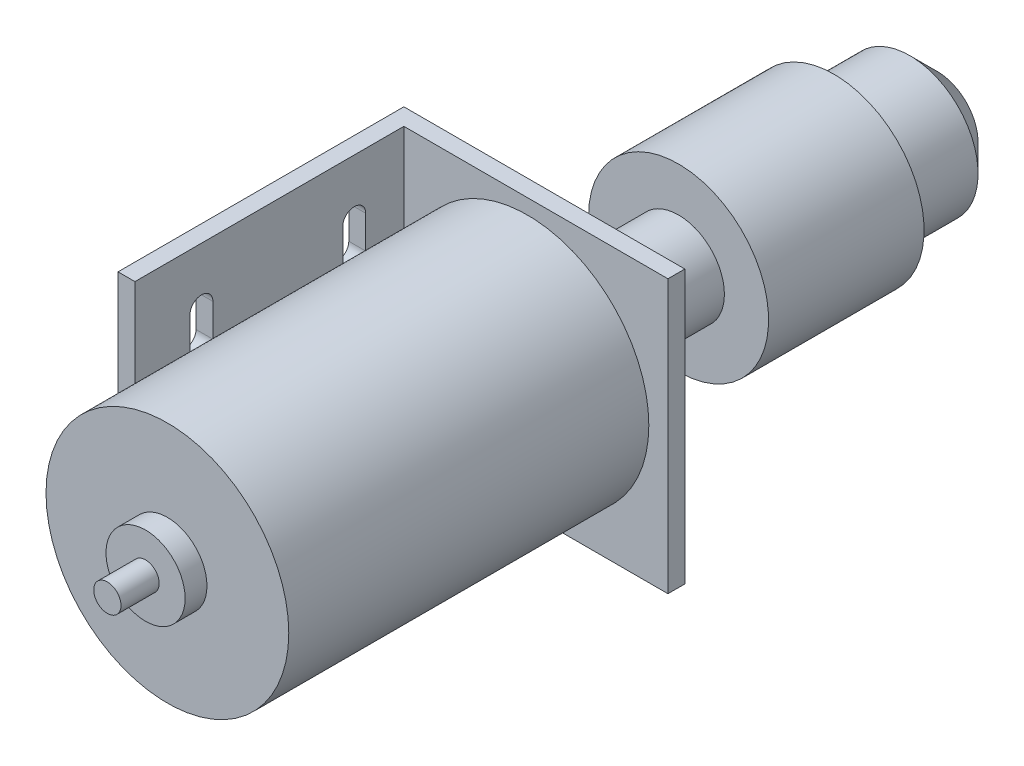
ISO-10303-21;
HEADER;
FILE_DESCRIPTION(('STEP AP214'),'2;1');
FILE_NAME('part.step','',(''),(''),'','','');
FILE_SCHEMA(('AUTOMOTIVE_DESIGN { 1 0 10303 214 1 1 1 1 }'));
ENDSEC;
DATA;
#1=APPLICATION_CONTEXT('core data for automotive mechanical design processes');
#2=APPLICATION_PROTOCOL_DEFINITION('international standard','automotive_design',2000,#1);
#3=PRODUCT_CONTEXT('',#1,'mechanical');
#4=PRODUCT('Part','Part','',(#3));
#5=PRODUCT_RELATED_PRODUCT_CATEGORY('part','',(#4));
#6=PRODUCT_DEFINITION_FORMATION('','',#4);
#7=PRODUCT_DEFINITION_CONTEXT('part definition',#1,'design');
#8=PRODUCT_DEFINITION('design','',#6,#7);
#9=PRODUCT_DEFINITION_SHAPE('','',#8);
#10=(LENGTH_UNIT() NAMED_UNIT(*) SI_UNIT(.MILLI.,.METRE.));
#11=(NAMED_UNIT(*) PLANE_ANGLE_UNIT() SI_UNIT($,.RADIAN.));
#12=(NAMED_UNIT(*) SI_UNIT($,.STERADIAN.) SOLID_ANGLE_UNIT());
#13=UNCERTAINTY_MEASURE_WITH_UNIT(LENGTH_MEASURE(1.E-05),#10,'distance_accuracy_value','');
#14=(GEOMETRIC_REPRESENTATION_CONTEXT(3) GLOBAL_UNCERTAINTY_ASSIGNED_CONTEXT((#13)) GLOBAL_UNIT_ASSIGNED_CONTEXT((#10,
#11,#12)) REPRESENTATION_CONTEXT('',''));
#15=CARTESIAN_POINT('',(0.,0.,0.));
#16=DIRECTION('',(0.,0.,1.));
#17=DIRECTION('',(1.,0.,0.));
#18=AXIS2_PLACEMENT_3D('',#15,#16,#17);
#19=CARTESIAN_POINT('',(0.,0.,0.));
#20=DIRECTION('',(0.,0.,1.));
#21=DIRECTION('',(1.,0.,0.));
#22=AXIS2_PLACEMENT_3D('',#19,#20,#21);
#23=PLANE('',#22);
#24=CARTESIAN_POINT('',(0.,0.,0.));
#25=DIRECTION('',(0.,0.,1.));
#26=DIRECTION('',(1.,0.,0.));
#27=AXIS2_PLACEMENT_3D('',#24,#25,#26);
#28=CIRCLE('',#27,22.25);
#29=CARTESIAN_POINT('',(22.25,0.,0.));
#30=VERTEX_POINT('',#29);
#31=EDGE_CURVE('E474',#30,#30,#28,.T.);
#32=ORIENTED_EDGE('',*,*,#31,.F.);
#33=EDGE_LOOP('',(#32));
#34=FACE_BOUND('',#33,.T.);
#35=DIRECTION('',(1.,0.,0.));
#36=VECTOR('',#35,1.);
#37=CARTESIAN_POINT('',(25.75,25.,0.));
#38=LINE('',#37,#36);
#39=CARTESIAN_POINT('',(-22.65,25.,0.));
#40=VERTEX_POINT('',#39);
#41=CARTESIAN_POINT('',(25.75,25.,0.));
#42=VERTEX_POINT('',#41);
#43=EDGE_CURVE('E434',#40,#42,#38,.T.);
#44=ORIENTED_EDGE('',*,*,#43,.F.);
#45=DIRECTION('',(0.,1.,0.));
#46=VECTOR('',#45,1.);
#47=CARTESIAN_POINT('',(-22.65,25.,0.));
#48=LINE('',#47,#46);
#49=CARTESIAN_POINT('',(-22.65,-25.,0.));
#50=VERTEX_POINT('',#49);
#51=EDGE_CURVE('E380',#50,#40,#48,.T.);
#52=ORIENTED_EDGE('',*,*,#51,.F.);
#53=DIRECTION('',(-1.,0.,0.));
#54=VECTOR('',#53,1.);
#55=CARTESIAN_POINT('',(25.75,-25.,0.));
#56=LINE('',#55,#54);
#57=CARTESIAN_POINT('',(25.75,-25.,0.));
#58=VERTEX_POINT('',#57);
#59=EDGE_CURVE('E443',#58,#50,#56,.T.);
#60=ORIENTED_EDGE('',*,*,#59,.F.);
#61=DIRECTION('',(0.,-1.,0.));
#62=VECTOR('',#61,1.);
#63=CARTESIAN_POINT('',(25.75,-25.,0.));
#64=LINE('',#63,#62);
#65=EDGE_CURVE('E455',#42,#58,#64,.T.);
#66=ORIENTED_EDGE('',*,*,#65,.F.);
#67=EDGE_LOOP('',(#44,#52,#60,#66));
#68=FACE_BOUND('',#67,.T.);
#69=ADVANCED_FACE('F63',(#34,#68),#23,.T.);
#70=CARTESIAN_POINT('',(0.,0.,66.));
#71=DIRECTION('',(0.,0.,-1.));
#72=DIRECTION('',(-1.,0.,0.));
#73=AXIS2_PLACEMENT_3D('',#70,#71,#72);
#74=CYLINDRICAL_SURFACE('',#73,22.25);
#75=CARTESIAN_POINT('',(0.,0.,66.));
#76=DIRECTION('',(0.,0.,1.));
#77=DIRECTION('',(1.,0.,0.));
#78=AXIS2_PLACEMENT_3D('',#75,#76,#77);
#79=CIRCLE('',#78,22.25);
#80=CARTESIAN_POINT('',(22.25,0.,66.));
#81=VERTEX_POINT('',#80);
#82=EDGE_CURVE('E491',#81,#81,#79,.T.);
#83=ORIENTED_EDGE('',*,*,#82,.F.);
#84=EDGE_LOOP('',(#83));
#85=FACE_BOUND('',#84,.T.);
#86=ORIENTED_EDGE('',*,*,#31,.T.);
#87=EDGE_LOOP('',(#86));
#88=FACE_BOUND('',#87,.T.);
#89=ADVANCED_FACE('F525',(#85,#88),#74,.T.);
#90=CARTESIAN_POINT('',(0.,0.,66.));
#91=DIRECTION('',(0.,0.,1.));
#92=DIRECTION('',(1.,0.,0.));
#93=AXIS2_PLACEMENT_3D('',#90,#91,#92);
#94=PLANE('',#93);
#95=CARTESIAN_POINT('',(0.,0.,66.));
#96=DIRECTION('',(0.,0.,1.));
#97=DIRECTION('',(1.,0.,0.));
#98=AXIS2_PLACEMENT_3D('',#95,#96,#97);
#99=CIRCLE('',#98,7.25);
#100=CARTESIAN_POINT('',(7.25,0.,66.));
#101=VERTEX_POINT('',#100);
#102=EDGE_CURVE('E487',#101,#101,#99,.T.);
#103=ORIENTED_EDGE('',*,*,#102,.F.);
#104=EDGE_LOOP('',(#103));
#105=FACE_BOUND('',#104,.T.);
#106=ORIENTED_EDGE('',*,*,#82,.T.);
#107=EDGE_LOOP('',(#106));
#108=FACE_BOUND('',#107,.T.);
#109=ADVANCED_FACE('F532',(#105,#108),#94,.T.);
#110=CARTESIAN_POINT('',(0.,0.,70.));
#111=DIRECTION('',(0.,0.,-1.));
#112=DIRECTION('',(-1.,0.,0.));
#113=AXIS2_PLACEMENT_3D('',#110,#111,#112);
#114=CYLINDRICAL_SURFACE('',#113,7.25);
#115=CARTESIAN_POINT('',(0.,0.,70.));
#116=DIRECTION('',(0.,0.,1.));
#117=DIRECTION('',(1.,0.,0.));
#118=AXIS2_PLACEMENT_3D('',#115,#116,#117);
#119=CIRCLE('',#118,7.25);
#120=CARTESIAN_POINT('',(7.25,0.,70.));
#121=VERTEX_POINT('',#120);
#122=EDGE_CURVE('E482',#121,#121,#119,.T.);
#123=ORIENTED_EDGE('',*,*,#122,.F.);
#124=EDGE_LOOP('',(#123));
#125=FACE_BOUND('',#124,.T.);
#126=ORIENTED_EDGE('',*,*,#102,.T.);
#127=EDGE_LOOP('',(#126));
#128=FACE_BOUND('',#127,.T.);
#129=ADVANCED_FACE('F566',(#125,#128),#114,.T.);
#130=CARTESIAN_POINT('',(0.,0.,70.));
#131=DIRECTION('',(0.,0.,1.));
#132=DIRECTION('',(1.,0.,0.));
#133=AXIS2_PLACEMENT_3D('',#130,#131,#132);
#134=PLANE('',#133);
#135=CARTESIAN_POINT('',(0.,0.,70.));
#136=DIRECTION('',(0.,0.,1.));
#137=DIRECTION('',(1.,0.,0.));
#138=AXIS2_PLACEMENT_3D('',#135,#136,#137);
#139=CIRCLE('',#138,2.5);
#140=CARTESIAN_POINT('',(2.5,0.,70.));
#141=VERTEX_POINT('',#140);
#142=EDGE_CURVE('E483',#141,#141,#139,.T.);
#143=ORIENTED_EDGE('',*,*,#142,.F.);
#144=EDGE_LOOP('',(#143));
#145=FACE_BOUND('',#144,.T.);
#146=ORIENTED_EDGE('',*,*,#122,.T.);
#147=EDGE_LOOP('',(#146));
#148=FACE_BOUND('',#147,.T.);
#149=ADVANCED_FACE('F562',(#145,#148),#134,.T.);
#150=CARTESIAN_POINT('',(0.,0.,77.));
#151=DIRECTION('',(0.,0.,-1.));
#152=DIRECTION('',(-1.,0.,0.));
#153=AXIS2_PLACEMENT_3D('',#150,#151,#152);
#154=CYLINDRICAL_SURFACE('',#153,2.5);
#155=CARTESIAN_POINT('',(0.,0.,77.));
#156=DIRECTION('',(0.,0.,1.));
#157=DIRECTION('',(1.,0.,0.));
#158=AXIS2_PLACEMENT_3D('',#155,#156,#157);
#159=CIRCLE('',#158,2.5);
#160=CARTESIAN_POINT('',(2.5,0.,77.));
#161=VERTEX_POINT('',#160);
#162=EDGE_CURVE('E478',#161,#161,#159,.T.);
#163=ORIENTED_EDGE('',*,*,#162,.F.);
#164=EDGE_LOOP('',(#163));
#165=FACE_BOUND('',#164,.T.);
#166=ORIENTED_EDGE('',*,*,#142,.T.);
#167=EDGE_LOOP('',(#166));
#168=FACE_BOUND('',#167,.T.);
#169=ADVANCED_FACE('F558',(#165,#168),#154,.T.);
#170=CARTESIAN_POINT('',(0.,0.,77.));
#171=DIRECTION('',(0.,0.,1.));
#172=DIRECTION('',(1.,0.,0.));
#173=AXIS2_PLACEMENT_3D('',#170,#171,#172);
#174=PLANE('',#173);
#175=ORIENTED_EDGE('',*,*,#162,.T.);
#176=EDGE_LOOP('',(#175));
#177=FACE_BOUND('',#176,.T.);
#178=ADVANCED_FACE('F555',(#177),#174,.T.);
#179=CARTESIAN_POINT('',(0.,0.,-3.1));
#180=DIRECTION('',(0.,0.,1.));
#181=DIRECTION('',(1.,0.,0.));
#182=AXIS2_PLACEMENT_3D('',#179,#180,#181);
#183=PLANE('',#182);
#184=DIRECTION('',(0.,1.,0.));
#185=VECTOR('',#184,1.);
#186=CARTESIAN_POINT('',(-25.75,-25.,-3.1));
#187=LINE('',#186,#185);
#188=CARTESIAN_POINT('',(-25.75,-25.,-3.1));
#189=VERTEX_POINT('',#188);
#190=CARTESIAN_POINT('',(-25.75,25.,-3.1));
#191=VERTEX_POINT('',#190);
#192=EDGE_CURVE('E438',#189,#191,#187,.T.);
#193=ORIENTED_EDGE('',*,*,#192,.T.);
#194=DIRECTION('',(1.,0.,0.));
#195=VECTOR('',#194,1.);
#196=CARTESIAN_POINT('',(25.75,25.,-3.1));
#197=LINE('',#196,#195);
#198=CARTESIAN_POINT('',(25.75,25.,-3.1));
#199=VERTEX_POINT('',#198);
#200=EDGE_CURVE('E442',#191,#199,#197,.T.);
#201=ORIENTED_EDGE('',*,*,#200,.T.);
#202=DIRECTION('',(0.,-1.,0.));
#203=VECTOR('',#202,1.);
#204=CARTESIAN_POINT('',(25.75,-25.,-3.1));
#205=LINE('',#204,#203);
#206=CARTESIAN_POINT('',(25.75,-25.,-3.1));
#207=VERTEX_POINT('',#206);
#208=EDGE_CURVE('E446',#199,#207,#205,.T.);
#209=ORIENTED_EDGE('',*,*,#208,.T.);
#210=DIRECTION('',(-1.,0.,0.));
#211=VECTOR('',#210,1.);
#212=CARTESIAN_POINT('',(25.75,-25.,-3.1));
#213=LINE('',#212,#211);
#214=EDGE_CURVE('E449',#207,#189,#213,.T.);
#215=ORIENTED_EDGE('',*,*,#214,.T.);
#216=EDGE_LOOP('',(#193,#201,#209,#215));
#217=FACE_BOUND('',#216,.T.);
#218=CARTESIAN_POINT('',(0.,0.,-3.1));
#219=DIRECTION('',(0.,0.,-1.));
#220=DIRECTION('',(-1.,0.,0.));
#221=AXIS2_PLACEMENT_3D('',#218,#219,#220);
#222=CIRCLE('',#221,8.6);
#223=CARTESIAN_POINT('',(-8.6,0.,-3.1));
#224=VERTEX_POINT('',#223);
#225=EDGE_CURVE('E430',#224,#224,#222,.T.);
#226=ORIENTED_EDGE('',*,*,#225,.F.);
#227=EDGE_LOOP('',(#226));
#228=FACE_BOUND('',#227,.T.);
#229=ADVANCED_FACE('F538',(#217,#228),#183,.F.);
#230=CARTESIAN_POINT('',(-25.75,-25.,-3.1));
#231=DIRECTION('',(1.,0.,0.));
#232=DIRECTION('',(0.,0.,-1.));
#233=AXIS2_PLACEMENT_3D('',#230,#231,#232);
#234=PLANE('',#233);
#235=CARTESIAN_POINT('',(-25.75,8.7,9.1));
#236=DIRECTION('',(-1.,0.,0.));
#237=DIRECTION('',(0.,0.,-1.));
#238=AXIS2_PLACEMENT_3D('',#235,#236,#237);
#239=CIRCLE('',#238,2.09999999999999);
#240=CARTESIAN_POINT('',(-25.75,8.7,7.00000000000001));
#241=VERTEX_POINT('',#240);
#242=CARTESIAN_POINT('',(-25.75,8.7,11.2));
#243=VERTEX_POINT('',#242);
#244=EDGE_CURVE('E330',#241,#243,#239,.T.);
#245=ORIENTED_EDGE('',*,*,#244,.F.);
#246=DIRECTION('',(0.,-1.,0.));
#247=VECTOR('',#246,1.);
#248=CARTESIAN_POINT('',(-25.75,14.7,7.00000000000001));
#249=LINE('',#248,#247);
#250=CARTESIAN_POINT('',(-25.75,14.7,7.00000000000001));
#251=VERTEX_POINT('',#250);
#252=EDGE_CURVE('E326',#251,#241,#249,.T.);
#253=ORIENTED_EDGE('',*,*,#252,.F.);
#254=CARTESIAN_POINT('',(-25.75,14.7,9.1));
#255=DIRECTION('',(-1.,0.,0.));
#256=DIRECTION('',(0.,0.,-1.));
#257=AXIS2_PLACEMENT_3D('',#254,#255,#256);
#258=CIRCLE('',#257,2.09999999999999);
#259=CARTESIAN_POINT('',(-25.75,14.7,11.2));
#260=VERTEX_POINT('',#259);
#261=EDGE_CURVE('E315',#260,#251,#258,.T.);
#262=ORIENTED_EDGE('',*,*,#261,.F.);
#263=DIRECTION('',(0.,1.,0.));
#264=VECTOR('',#263,1.);
#265=CARTESIAN_POINT('',(-25.75,14.7,11.2));
#266=LINE('',#265,#264);
#267=EDGE_CURVE('E80',#243,#260,#266,.T.);
#268=ORIENTED_EDGE('',*,*,#267,.F.);
#269=EDGE_LOOP('',(#245,#253,#262,#268));
#270=FACE_BOUND('',#269,.T.);
#271=CARTESIAN_POINT('',(-25.75,-8.7,9.1));
#272=DIRECTION('',(-1.,0.,0.));
#273=DIRECTION('',(0.,0.,1.));
#274=AXIS2_PLACEMENT_3D('',#271,#272,#273);
#275=CIRCLE('',#274,2.09999999999999);
#276=CARTESIAN_POINT('',(-25.75,-8.7,11.2));
#277=VERTEX_POINT('',#276);
#278=CARTESIAN_POINT('',(-25.75,-8.7,7.00000000000001));
#279=VERTEX_POINT('',#278);
#280=EDGE_CURVE('E290',#277,#279,#275,.T.);
#281=ORIENTED_EDGE('',*,*,#280,.F.);
#282=DIRECTION('',(0.,1.,0.));
#283=VECTOR('',#282,1.);
#284=CARTESIAN_POINT('',(-25.75,-14.7,11.2));
#285=LINE('',#284,#283);
#286=CARTESIAN_POINT('',(-25.75,-14.7,11.2));
#287=VERTEX_POINT('',#286);
#288=EDGE_CURVE('E286',#287,#277,#285,.T.);
#289=ORIENTED_EDGE('',*,*,#288,.F.);
#290=CARTESIAN_POINT('',(-25.75,-14.7,9.1));
#291=DIRECTION('',(-1.,0.,0.));
#292=DIRECTION('',(0.,0.,1.));
#293=AXIS2_PLACEMENT_3D('',#290,#291,#292);
#294=CIRCLE('',#293,2.09999999999999);
#295=CARTESIAN_POINT('',(-25.75,-14.7,7.00000000000001));
#296=VERTEX_POINT('',#295);
#297=EDGE_CURVE('E275',#296,#287,#294,.T.);
#298=ORIENTED_EDGE('',*,*,#297,.F.);
#299=DIRECTION('',(0.,-1.,0.));
#300=VECTOR('',#299,1.);
#301=CARTESIAN_POINT('',(-25.75,-14.7,7.00000000000001));
#302=LINE('',#301,#300);
#303=EDGE_CURVE('E88',#279,#296,#302,.T.);
#304=ORIENTED_EDGE('',*,*,#303,.F.);
#305=EDGE_LOOP('',(#281,#289,#298,#304));
#306=FACE_BOUND('',#305,.T.);
#307=CARTESIAN_POINT('',(-25.75,-8.7,37.1));
#308=DIRECTION('',(-1.,0.,0.));
#309=DIRECTION('',(0.,0.,-1.));
#310=AXIS2_PLACEMENT_3D('',#307,#308,#309);
#311=CIRCLE('',#310,2.09999999999999);
#312=CARTESIAN_POINT('',(-25.75,-8.7,39.2));
#313=VERTEX_POINT('',#312);
#314=CARTESIAN_POINT('',(-25.75,-8.7,35.));
#315=VERTEX_POINT('',#314);
#316=EDGE_CURVE('E241',#313,#315,#311,.T.);
#317=ORIENTED_EDGE('',*,*,#316,.F.);
#318=DIRECTION('',(0.,1.,0.));
#319=VECTOR('',#318,1.);
#320=CARTESIAN_POINT('',(-25.75,-14.7,39.2));
#321=LINE('',#320,#319);
#322=CARTESIAN_POINT('',(-25.75,-14.7,39.2));
#323=VERTEX_POINT('',#322);
#324=EDGE_CURVE('E218',#323,#313,#321,.T.);
#325=ORIENTED_EDGE('',*,*,#324,.F.);
#326=CARTESIAN_POINT('',(-25.75,-14.7,37.1));
#327=DIRECTION('',(-1.,0.,0.));
#328=DIRECTION('',(0.,0.,-1.));
#329=AXIS2_PLACEMENT_3D('',#326,#327,#328);
#330=CIRCLE('',#329,2.09999999999999);
#331=CARTESIAN_POINT('',(-25.75,-14.7,35.));
#332=VERTEX_POINT('',#331);
#333=EDGE_CURVE('E231',#332,#323,#330,.T.);
#334=ORIENTED_EDGE('',*,*,#333,.F.);
#335=DIRECTION('',(0.,-1.,0.));
#336=VECTOR('',#335,1.);
#337=CARTESIAN_POINT('',(-25.75,-14.7,35.));
#338=LINE('',#337,#336);
#339=EDGE_CURVE('E246',#315,#332,#338,.T.);
#340=ORIENTED_EDGE('',*,*,#339,.F.);
#341=EDGE_LOOP('',(#317,#325,#334,#340));
#342=FACE_BOUND('',#341,.T.);
#343=CARTESIAN_POINT('',(-25.75,8.7,37.1));
#344=DIRECTION('',(-1.,0.,0.));
#345=DIRECTION('',(0.,0.,1.));
#346=AXIS2_PLACEMENT_3D('',#343,#344,#345);
#347=CIRCLE('',#346,2.09999999999999);
#348=CARTESIAN_POINT('',(-25.75,8.7,35.));
#349=VERTEX_POINT('',#348);
#350=CARTESIAN_POINT('',(-25.75,8.7,39.2));
#351=VERTEX_POINT('',#350);
#352=EDGE_CURVE('E345',#349,#351,#347,.T.);
#353=ORIENTED_EDGE('',*,*,#352,.F.);
#354=DIRECTION('',(0.,-1.,0.));
#355=VECTOR('',#354,1.);
#356=CARTESIAN_POINT('',(-25.75,14.7,35.));
#357=LINE('',#356,#355);
#358=CARTESIAN_POINT('',(-25.75,14.7,35.));
#359=VERTEX_POINT('',#358);
#360=EDGE_CURVE('E349',#359,#349,#357,.T.);
#361=ORIENTED_EDGE('',*,*,#360,.F.);
#362=CARTESIAN_POINT('',(-25.75,14.7,37.1));
#363=DIRECTION('',(-1.,0.,0.));
#364=DIRECTION('',(0.,0.,1.));
#365=AXIS2_PLACEMENT_3D('',#362,#363,#364);
#366=CIRCLE('',#365,2.09999999999999);
#367=CARTESIAN_POINT('',(-25.75,14.7,39.2));
#368=VERTEX_POINT('',#367);
#369=EDGE_CURVE('E353',#368,#359,#366,.T.);
#370=ORIENTED_EDGE('',*,*,#369,.F.);
#371=DIRECTION('',(0.,1.,0.));
#372=VECTOR('',#371,1.);
#373=CARTESIAN_POINT('',(-25.75,14.7,39.2));
#374=LINE('',#373,#372);
#375=EDGE_CURVE('E341',#351,#368,#374,.T.);
#376=ORIENTED_EDGE('',*,*,#375,.F.);
#377=EDGE_LOOP('',(#353,#361,#370,#376));
#378=FACE_BOUND('',#377,.T.);
#379=DIRECTION('',(0.,0.,1.));
#380=VECTOR('',#379,1.);
#381=CARTESIAN_POINT('',(-25.75,-25.,-3.1));
#382=LINE('',#381,#380);
#383=CARTESIAN_POINT('',(-25.75,-25.,49.3));
#384=VERTEX_POINT('',#383);
#385=EDGE_CURVE('E452',#189,#384,#382,.T.);
#386=ORIENTED_EDGE('',*,*,#385,.T.);
#387=DIRECTION('',(0.,-1.,0.));
#388=VECTOR('',#387,1.);
#389=CARTESIAN_POINT('',(-25.75,25.,49.3));
#390=LINE('',#389,#388);
#391=CARTESIAN_POINT('',(-25.75,25.,49.3));
#392=VERTEX_POINT('',#391);
#393=EDGE_CURVE('E381',#392,#384,#390,.T.);
#394=ORIENTED_EDGE('',*,*,#393,.F.);
#395=DIRECTION('',(0.,0.,1.));
#396=VECTOR('',#395,1.);
#397=CARTESIAN_POINT('',(-25.75,25.,-3.1));
#398=LINE('',#397,#396);
#399=EDGE_CURVE('E471',#191,#392,#398,.T.);
#400=ORIENTED_EDGE('',*,*,#399,.F.);
#401=ORIENTED_EDGE('',*,*,#192,.F.);
#402=EDGE_LOOP('',(#386,#394,#400,#401));
#403=FACE_BOUND('',#402,.T.);
#404=ADVANCED_FACE('F238',(#270,#306,#342,#378,#403),#234,.F.);
#405=CARTESIAN_POINT('',(25.75,25.,-3.1));
#406=DIRECTION('',(0.,-1.,0.));
#407=DIRECTION('',(0.,0.,-1.));
#408=AXIS2_PLACEMENT_3D('',#405,#406,#407);
#409=PLANE('',#408);
#410=ORIENTED_EDGE('',*,*,#399,.T.);
#411=DIRECTION('',(-1.,0.,0.));
#412=VECTOR('',#411,1.);
#413=CARTESIAN_POINT('',(-25.75,25.,49.3));
#414=LINE('',#413,#412);
#415=CARTESIAN_POINT('',(-22.65,25.,49.3));
#416=VERTEX_POINT('',#415);
#417=EDGE_CURVE('E391',#416,#392,#414,.T.);
#418=ORIENTED_EDGE('',*,*,#417,.F.);
#419=DIRECTION('',(0.,0.,-1.));
#420=VECTOR('',#419,1.);
#421=CARTESIAN_POINT('',(-22.65,25.,49.3));
#422=LINE('',#421,#420);
#423=EDGE_CURVE('E395',#416,#40,#422,.T.);
#424=ORIENTED_EDGE('',*,*,#423,.T.);
#425=ORIENTED_EDGE('',*,*,#43,.T.);
#426=DIRECTION('',(0.,0.,1.));
#427=VECTOR('',#426,1.);
#428=CARTESIAN_POINT('',(25.75,25.,-3.1));
#429=LINE('',#428,#427);
#430=EDGE_CURVE('E467',#199,#42,#429,.T.);
#431=ORIENTED_EDGE('',*,*,#430,.F.);
#432=ORIENTED_EDGE('',*,*,#200,.F.);
#433=EDGE_LOOP('',(#410,#418,#424,#425,#431,#432));
#434=FACE_BOUND('',#433,.T.);
#435=ADVANCED_FACE('F548',(#434),#409,.F.);
#436=CARTESIAN_POINT('',(25.75,-25.,-3.1));
#437=DIRECTION('',(-1.,0.,0.));
#438=DIRECTION('',(0.,0.,1.));
#439=AXIS2_PLACEMENT_3D('',#436,#437,#438);
#440=PLANE('',#439);
#441=ORIENTED_EDGE('',*,*,#65,.T.);
#442=DIRECTION('',(0.,0.,1.));
#443=VECTOR('',#442,1.);
#444=CARTESIAN_POINT('',(25.75,-25.,-3.1));
#445=LINE('',#444,#443);
#446=EDGE_CURVE('E463',#207,#58,#445,.T.);
#447=ORIENTED_EDGE('',*,*,#446,.F.);
#448=ORIENTED_EDGE('',*,*,#208,.F.);
#449=ORIENTED_EDGE('',*,*,#430,.T.);
#450=EDGE_LOOP('',(#441,#447,#448,#449));
#451=FACE_BOUND('',#450,.T.);
#452=ADVANCED_FACE('F544',(#451),#440,.F.);
#453=CARTESIAN_POINT('',(25.75,-25.,-3.1));
#454=DIRECTION('',(0.,1.,0.));
#455=DIRECTION('',(0.,0.,1.));
#456=AXIS2_PLACEMENT_3D('',#453,#454,#455);
#457=PLANE('',#456);
#458=ORIENTED_EDGE('',*,*,#59,.T.);
#459=DIRECTION('',(0.,0.,-1.));
#460=VECTOR('',#459,1.);
#461=CARTESIAN_POINT('',(-22.65,-25.,49.3));
#462=LINE('',#461,#460);
#463=CARTESIAN_POINT('',(-22.65,-25.,49.3));
#464=VERTEX_POINT('',#463);
#465=EDGE_CURVE('E401',#464,#50,#462,.T.);
#466=ORIENTED_EDGE('',*,*,#465,.F.);
#467=DIRECTION('',(1.,0.,0.));
#468=VECTOR('',#467,1.);
#469=CARTESIAN_POINT('',(-25.75,-25.,49.3));
#470=LINE('',#469,#468);
#471=EDGE_CURVE('E385',#384,#464,#470,.T.);
#472=ORIENTED_EDGE('',*,*,#471,.F.);
#473=ORIENTED_EDGE('',*,*,#385,.F.);
#474=ORIENTED_EDGE('',*,*,#214,.F.);
#475=ORIENTED_EDGE('',*,*,#446,.T.);
#476=EDGE_LOOP('',(#458,#466,#472,#473,#474,#475));
#477=FACE_BOUND('',#476,.T.);
#478=ADVANCED_FACE('F540',(#477),#457,.F.);
#479=CARTESIAN_POINT('',(0.,0.,-3.1));
#480=DIRECTION('',(0.,0.,1.));
#481=DIRECTION('',(1.,0.,0.));
#482=AXIS2_PLACEMENT_3D('',#479,#480,#481);
#483=CYLINDRICAL_SURFACE('',#482,8.6);
#484=ORIENTED_EDGE('',*,*,#225,.T.);
#485=EDGE_LOOP('',(#484));
#486=FACE_BOUND('',#485,.T.);
#487=CARTESIAN_POINT('',(0.,0.,0.));
#488=DIRECTION('',(0.,0.,-1.));
#489=DIRECTION('',(-1.,0.,0.));
#490=AXIS2_PLACEMENT_3D('',#487,#488,#489);
#491=CIRCLE('',#490,8.6);
#492=CARTESIAN_POINT('',(-8.6,0.,0.));
#493=VERTEX_POINT('',#492);
#494=EDGE_CURVE('E429',#493,#493,#491,.T.);
#495=ORIENTED_EDGE('',*,*,#494,.F.);
#496=EDGE_LOOP('',(#495));
#497=FACE_BOUND('',#496,.T.);
#498=ADVANCED_FACE('F543',(#486,#497),#483,.F.);
#499=CARTESIAN_POINT('',(0.,0.,0.));
#500=DIRECTION('',(0.,0.,1.));
#501=DIRECTION('',(1.,0.,0.));
#502=AXIS2_PLACEMENT_3D('',#499,#500,#501);
#503=PLANE('',#502);
#504=CARTESIAN_POINT('',(0.,0.,0.));
#505=DIRECTION('',(0.,0.,1.));
#506=DIRECTION('',(1.,0.,0.));
#507=AXIS2_PLACEMENT_3D('',#504,#505,#506);
#508=CIRCLE('',#507,8.4);
#509=CARTESIAN_POINT('',(8.4,0.,0.));
#510=VERTEX_POINT('',#509);
#511=EDGE_CURVE('E417',#510,#510,#508,.F.);
#512=ORIENTED_EDGE('',*,*,#511,.F.);
#513=EDGE_LOOP('',(#512));
#514=FACE_BOUND('',#513,.T.);
#515=ORIENTED_EDGE('',*,*,#494,.T.);
#516=EDGE_LOOP('',(#515));
#517=FACE_BOUND('',#516,.T.);
#518=ADVANCED_FACE('F574',(#514,#517),#503,.F.);
#519=CARTESIAN_POINT('',(0.,0.,-27.7));
#520=DIRECTION('',(0.,0.,1.));
#521=DIRECTION('',(1.,0.,0.));
#522=AXIS2_PLACEMENT_3D('',#519,#520,#521);
#523=CYLINDRICAL_SURFACE('',#522,8.4);
#524=CARTESIAN_POINT('',(0.,0.,-27.7));
#525=DIRECTION('',(0.,0.,-1.));
#526=DIRECTION('',(-1.,0.,0.));
#527=AXIS2_PLACEMENT_3D('',#524,#525,#526);
#528=CIRCLE('',#527,8.4);
#529=CARTESIAN_POINT('',(-8.4,0.,-27.7));
#530=VERTEX_POINT('',#529);
#531=EDGE_CURVE('E422',#530,#530,#528,.T.);
#532=ORIENTED_EDGE('',*,*,#531,.F.);
#533=EDGE_LOOP('',(#532));
#534=FACE_BOUND('',#533,.T.);
#535=ORIENTED_EDGE('',*,*,#511,.T.);
#536=EDGE_LOOP('',(#535));
#537=FACE_BOUND('',#536,.T.);
#538=ADVANCED_FACE('F576',(#534,#537),#523,.T.);
#539=CARTESIAN_POINT('',(0.,0.,-56.2));
#540=DIRECTION('',(0.,0.,1.));
#541=DIRECTION('',(1.,0.,0.));
#542=AXIS2_PLACEMENT_3D('',#539,#540,#541);
#543=CYLINDRICAL_SURFACE('',#542,16.5);
#544=CARTESIAN_POINT('',(0.,0.,-56.2));
#545=DIRECTION('',(0.,0.,-1.));
#546=DIRECTION('',(-1.,0.,0.));
#547=AXIS2_PLACEMENT_3D('',#544,#545,#546);
#548=CIRCLE('',#547,16.5);
#549=CARTESIAN_POINT('',(-16.5,0.,-56.2));
#550=VERTEX_POINT('',#549);
#551=EDGE_CURVE('E418',#550,#550,#548,.T.);
#552=ORIENTED_EDGE('',*,*,#551,.F.);
#553=EDGE_LOOP('',(#552));
#554=FACE_BOUND('',#553,.T.);
#555=CARTESIAN_POINT('',(0.,0.,-27.7));
#556=DIRECTION('',(0.,0.,-1.));
#557=DIRECTION('',(-1.,0.,0.));
#558=AXIS2_PLACEMENT_3D('',#555,#556,#557);
#559=CIRCLE('',#558,16.5);
#560=CARTESIAN_POINT('',(-16.5,0.,-27.7));
#561=VERTEX_POINT('',#560);
#562=EDGE_CURVE('E409',#561,#561,#559,.T.);
#563=ORIENTED_EDGE('',*,*,#562,.T.);
#564=EDGE_LOOP('',(#563));
#565=FACE_BOUND('',#564,.T.);
#566=ADVANCED_FACE('F582',(#554,#565),#543,.T.);
#567=CARTESIAN_POINT('',(0.,0.,-56.2));
#568=DIRECTION('',(0.,0.,-1.));
#569=DIRECTION('',(-1.,0.,0.));
#570=AXIS2_PLACEMENT_3D('',#567,#568,#569);
#571=PLANE('',#570);
#572=CARTESIAN_POINT('',(0.,0.,-56.2));
#573=DIRECTION('',(0.,0.,-1.));
#574=DIRECTION('',(-1.,0.,0.));
#575=AXIS2_PLACEMENT_3D('',#572,#573,#574);
#576=CIRCLE('',#575,12.5);
#577=CARTESIAN_POINT('',(-12.5,0.,-56.2));
#578=VERTEX_POINT('',#577);
#579=EDGE_CURVE('E413',#578,#578,#576,.T.);
#580=ORIENTED_EDGE('',*,*,#579,.F.);
#581=EDGE_LOOP('',(#580));
#582=FACE_BOUND('',#581,.T.);
#583=ORIENTED_EDGE('',*,*,#551,.T.);
#584=EDGE_LOOP('',(#583));
#585=FACE_BOUND('',#584,.T.);
#586=ADVANCED_FACE('F596',(#582,#585),#571,.T.);
#587=CARTESIAN_POINT('',(0.,0.,-27.7));
#588=DIRECTION('',(0.,0.,-1.));
#589=DIRECTION('',(-1.,0.,0.));
#590=AXIS2_PLACEMENT_3D('',#587,#588,#589);
#591=PLANE('',#590);
#592=ORIENTED_EDGE('',*,*,#531,.T.);
#593=EDGE_LOOP('',(#592));
#594=FACE_BOUND('',#593,.T.);
#595=ORIENTED_EDGE('',*,*,#562,.F.);
#596=EDGE_LOOP('',(#595));
#597=FACE_BOUND('',#596,.T.);
#598=ADVANCED_FACE('F598',(#594,#597),#591,.F.);
#599=CARTESIAN_POINT('',(0.,0.,-75.1));
#600=DIRECTION('',(0.,0.,1.));
#601=DIRECTION('',(1.,0.,0.));
#602=AXIS2_PLACEMENT_3D('',#599,#600,#601);
#603=CYLINDRICAL_SURFACE('',#602,12.5);
#604=CARTESIAN_POINT('',(0.,0.,-70.1));
#605=DIRECTION('',(0.,0.,-1.));
#606=DIRECTION('',(-1.,0.,0.));
#607=AXIS2_PLACEMENT_3D('',#604,#605,#606);
#608=CIRCLE('',#607,12.5);
#609=CARTESIAN_POINT('',(-12.5,0.,-70.1));
#610=VERTEX_POINT('',#609);
#611=EDGE_CURVE('E13',#610,#610,#608,.F.);
#612=ORIENTED_EDGE('',*,*,#611,.T.);
#613=EDGE_LOOP('',(#612));
#614=FACE_BOUND('',#613,.T.);
#615=ORIENTED_EDGE('',*,*,#579,.T.);
#616=EDGE_LOOP('',(#615));
#617=FACE_BOUND('',#616,.T.);
#618=ADVANCED_FACE('F601',(#614,#617),#603,.T.);
#619=CARTESIAN_POINT('',(0.,0.,-75.1));
#620=DIRECTION('',(0.,0.,-1.));
#621=DIRECTION('',(-1.,0.,0.));
#622=AXIS2_PLACEMENT_3D('',#619,#620,#621);
#623=PLANE('',#622);
#624=CARTESIAN_POINT('',(0.,0.,-75.1));
#625=DIRECTION('',(0.,0.,-1.));
#626=DIRECTION('',(-1.,0.,0.));
#627=AXIS2_PLACEMENT_3D('',#624,#625,#626);
#628=CIRCLE('',#627,7.49999999999999);
#629=CARTESIAN_POINT('',(-7.49999999999999,0.,-75.1));
#630=VERTEX_POINT('',#629);
#631=EDGE_CURVE('E73',#630,#630,#628,.T.);
#632=ORIENTED_EDGE('',*,*,#631,.T.);
#633=EDGE_LOOP('',(#632));
#634=FACE_BOUND('',#633,.T.);
#635=CARTESIAN_POINT('',(0.,0.,-75.1));
#636=DIRECTION('',(0.,0.,-1.));
#637=DIRECTION('',(-1.,0.,0.));
#638=AXIS2_PLACEMENT_3D('',#635,#636,#637);
#639=CIRCLE('',#638,5.3);
#640=CARTESIAN_POINT('',(-5.3,0.,-75.1));
#641=VERTEX_POINT('',#640);
#642=EDGE_CURVE('E404',#641,#641,#639,.T.);
#643=ORIENTED_EDGE('',*,*,#642,.F.);
#644=EDGE_LOOP('',(#643));
#645=FACE_BOUND('',#644,.T.);
#646=ADVANCED_FACE('F505',(#634,#645),#623,.T.);
#647=CARTESIAN_POINT('',(0.,0.,-48.7));
#648=DIRECTION('',(0.,0.,-1.));
#649=DIRECTION('',(-1.,0.,0.));
#650=AXIS2_PLACEMENT_3D('',#647,#648,#649);
#651=CYLINDRICAL_SURFACE('',#650,5.3);
#652=CARTESIAN_POINT('',(0.,0.,-48.7));
#653=DIRECTION('',(0.,0.,-1.));
#654=DIRECTION('',(-1.,0.,0.));
#655=AXIS2_PLACEMENT_3D('',#652,#653,#654);
#656=CIRCLE('',#655,5.3);
#657=CARTESIAN_POINT('',(-5.3,0.,-48.7));
#658=VERTEX_POINT('',#657);
#659=EDGE_CURVE('E405',#658,#658,#656,.T.);
#660=ORIENTED_EDGE('',*,*,#659,.F.);
#661=EDGE_LOOP('',(#660));
#662=FACE_BOUND('',#661,.T.);
#663=ORIENTED_EDGE('',*,*,#642,.T.);
#664=EDGE_LOOP('',(#663));
#665=FACE_BOUND('',#664,.T.);
#666=ADVANCED_FACE('F521',(#662,#665),#651,.F.);
#667=CARTESIAN_POINT('',(0.,0.,-48.7));
#668=DIRECTION('',(0.,0.,-1.));
#669=DIRECTION('',(-1.,0.,0.));
#670=AXIS2_PLACEMENT_3D('',#667,#668,#669);
#671=PLANE('',#670);
#672=ORIENTED_EDGE('',*,*,#659,.T.);
#673=EDGE_LOOP('',(#672));
#674=FACE_BOUND('',#673,.T.);
#675=ADVANCED_FACE('F510',(#674),#671,.T.);
#676=CARTESIAN_POINT('',(0.,0.,-75.1));
#677=DIRECTION('',(0.,0.,1.));
#678=DIRECTION('',(1.,0.,0.));
#679=AXIS2_PLACEMENT_3D('',#676,#677,#678);
#680=CONICAL_SURFACE('',#679,7.49999999999999,0.785398163397449);
#681=ORIENTED_EDGE('',*,*,#611,.F.);
#682=EDGE_LOOP('',(#681));
#683=FACE_BOUND('',#682,.T.);
#684=ORIENTED_EDGE('',*,*,#631,.F.);
#685=EDGE_LOOP('',(#684));
#686=FACE_BOUND('',#685,.T.);
#687=ADVANCED_FACE('F66',(#683,#686),#680,.T.);
#688=CARTESIAN_POINT('',(-22.65,25.,49.3));
#689=DIRECTION('',(-1.,0.,0.));
#690=DIRECTION('',(0.,-1.,0.));
#691=AXIS2_PLACEMENT_3D('',#688,#689,#690);
#692=PLANE('',#691);
#693=CARTESIAN_POINT('',(-22.65,14.7,9.1));
#694=DIRECTION('',(-1.,0.,0.));
#695=DIRECTION('',(0.,-1.,0.));
#696=AXIS2_PLACEMENT_3D('',#693,#694,#695);
#697=CIRCLE('',#696,2.09999999999999);
#698=CARTESIAN_POINT('',(-22.65,14.7,7.00000000000001));
#699=VERTEX_POINT('',#698);
#700=CARTESIAN_POINT('',(-22.65,14.7,11.2));
#701=VERTEX_POINT('',#700);
#702=EDGE_CURVE('E319',#699,#701,#697,.F.);
#703=ORIENTED_EDGE('',*,*,#702,.F.);
#704=DIRECTION('',(0.,1.,0.));
#705=VECTOR('',#704,1.);
#706=CARTESIAN_POINT('',(-22.65,14.7,7.00000000000001));
#707=LINE('',#706,#705);
#708=CARTESIAN_POINT('',(-22.65,8.7,7.00000000000001));
#709=VERTEX_POINT('',#708);
#710=EDGE_CURVE('E261',#709,#699,#707,.T.);
#711=ORIENTED_EDGE('',*,*,#710,.F.);
#712=CARTESIAN_POINT('',(-22.65,8.7,9.1));
#713=DIRECTION('',(-1.,0.,0.));
#714=DIRECTION('',(0.,-1.,0.));
#715=AXIS2_PLACEMENT_3D('',#712,#713,#714);
#716=CIRCLE('',#715,2.09999999999999);
#717=CARTESIAN_POINT('',(-22.65,8.7,11.2));
#718=VERTEX_POINT('',#717);
#719=EDGE_CURVE('E310',#718,#709,#716,.F.);
#720=ORIENTED_EDGE('',*,*,#719,.F.);
#721=DIRECTION('',(0.,-1.,0.));
#722=VECTOR('',#721,1.);
#723=CARTESIAN_POINT('',(-22.65,14.7,11.2));
#724=LINE('',#723,#722);
#725=EDGE_CURVE('E314',#701,#718,#724,.T.);
#726=ORIENTED_EDGE('',*,*,#725,.F.);
#727=EDGE_LOOP('',(#703,#711,#720,#726));
#728=FACE_BOUND('',#727,.T.);
#729=CARTESIAN_POINT('',(-22.65,-14.7,9.1));
#730=DIRECTION('',(-1.,0.,0.));
#731=DIRECTION('',(0.,-1.,0.));
#732=AXIS2_PLACEMENT_3D('',#729,#730,#731);
#733=CIRCLE('',#732,2.09999999999999);
#734=CARTESIAN_POINT('',(-22.65,-14.7,11.2));
#735=VERTEX_POINT('',#734);
#736=CARTESIAN_POINT('',(-22.65,-14.7,7.00000000000001));
#737=VERTEX_POINT('',#736);
#738=EDGE_CURVE('E279',#735,#737,#733,.F.);
#739=ORIENTED_EDGE('',*,*,#738,.F.);
#740=DIRECTION('',(0.,-1.,0.));
#741=VECTOR('',#740,1.);
#742=CARTESIAN_POINT('',(-22.65,-14.7,11.2));
#743=LINE('',#742,#741);
#744=CARTESIAN_POINT('',(-22.65,-8.7,11.2));
#745=VERTEX_POINT('',#744);
#746=EDGE_CURVE('E227',#745,#735,#743,.T.);
#747=ORIENTED_EDGE('',*,*,#746,.F.);
#748=CARTESIAN_POINT('',(-22.65,-8.7,9.1));
#749=DIRECTION('',(-1.,0.,0.));
#750=DIRECTION('',(0.,-1.,0.));
#751=AXIS2_PLACEMENT_3D('',#748,#749,#750);
#752=CIRCLE('',#751,2.09999999999999);
#753=CARTESIAN_POINT('',(-22.65,-8.7,7.00000000000001));
#754=VERTEX_POINT('',#753);
#755=EDGE_CURVE('E270',#754,#745,#752,.F.);
#756=ORIENTED_EDGE('',*,*,#755,.F.);
#757=DIRECTION('',(0.,1.,0.));
#758=VECTOR('',#757,1.);
#759=CARTESIAN_POINT('',(-22.65,-14.7,7.00000000000001));
#760=LINE('',#759,#758);
#761=EDGE_CURVE('E274',#737,#754,#760,.T.);
#762=ORIENTED_EDGE('',*,*,#761,.F.);
#763=EDGE_LOOP('',(#739,#747,#756,#762));
#764=FACE_BOUND('',#763,.T.);
#765=CARTESIAN_POINT('',(-22.65,-14.7,37.1));
#766=DIRECTION('',(-1.,0.,0.));
#767=DIRECTION('',(0.,-1.,0.));
#768=AXIS2_PLACEMENT_3D('',#765,#766,#767);
#769=CIRCLE('',#768,2.09999999999999);
#770=CARTESIAN_POINT('',(-22.65,-14.7,39.2));
#771=VERTEX_POINT('',#770);
#772=CARTESIAN_POINT('',(-22.65,-14.7,35.));
#773=VERTEX_POINT('',#772);
#774=EDGE_CURVE('E256',#771,#773,#769,.F.);
#775=ORIENTED_EDGE('',*,*,#774,.F.);
#776=DIRECTION('',(0.,-1.,0.));
#777=VECTOR('',#776,1.);
#778=CARTESIAN_POINT('',(-22.65,-14.7,39.2));
#779=LINE('',#778,#777);
#780=CARTESIAN_POINT('',(-22.65,-8.7,39.2));
#781=VERTEX_POINT('',#780);
#782=EDGE_CURVE('E221',#781,#771,#779,.T.);
#783=ORIENTED_EDGE('',*,*,#782,.F.);
#784=CARTESIAN_POINT('',(-22.65,-8.7,37.1));
#785=DIRECTION('',(-1.,0.,0.));
#786=DIRECTION('',(0.,-1.,0.));
#787=AXIS2_PLACEMENT_3D('',#784,#785,#786);
#788=CIRCLE('',#787,2.09999999999999);
#789=CARTESIAN_POINT('',(-22.65,-8.7,35.));
#790=VERTEX_POINT('',#789);
#791=EDGE_CURVE('E236',#790,#781,#788,.F.);
#792=ORIENTED_EDGE('',*,*,#791,.F.);
#793=DIRECTION('',(0.,1.,0.));
#794=VECTOR('',#793,1.);
#795=CARTESIAN_POINT('',(-22.65,-14.7,35.));
#796=LINE('',#795,#794);
#797=EDGE_CURVE('E950',#773,#790,#796,.T.);
#798=ORIENTED_EDGE('',*,*,#797,.F.);
#799=EDGE_LOOP('',(#775,#783,#792,#798));
#800=FACE_BOUND('',#799,.T.);
#801=CARTESIAN_POINT('',(-22.65,14.7,37.1));
#802=DIRECTION('',(-1.,0.,0.));
#803=DIRECTION('',(0.,-1.,0.));
#804=AXIS2_PLACEMENT_3D('',#801,#802,#803);
#805=CIRCLE('',#804,2.09999999999999);
#806=CARTESIAN_POINT('',(-22.65,14.7,35.));
#807=VERTEX_POINT('',#806);
#808=CARTESIAN_POINT('',(-22.65,14.7,39.2));
#809=VERTEX_POINT('',#808);
#810=EDGE_CURVE('E340',#807,#809,#805,.F.);
#811=ORIENTED_EDGE('',*,*,#810,.F.);
#812=DIRECTION('',(0.,1.,0.));
#813=VECTOR('',#812,1.);
#814=CARTESIAN_POINT('',(-22.65,14.7,35.));
#815=LINE('',#814,#813);
#816=CARTESIAN_POINT('',(-22.65,8.7,35.));
#817=VERTEX_POINT('',#816);
#818=EDGE_CURVE('E255',#817,#807,#815,.T.);
#819=ORIENTED_EDGE('',*,*,#818,.F.);
#820=CARTESIAN_POINT('',(-22.65,8.7,37.1));
#821=DIRECTION('',(-1.,0.,0.));
#822=DIRECTION('',(0.,-1.,0.));
#823=AXIS2_PLACEMENT_3D('',#820,#821,#822);
#824=CIRCLE('',#823,2.09999999999999);
#825=CARTESIAN_POINT('',(-22.65,8.7,39.2));
#826=VERTEX_POINT('',#825);
#827=EDGE_CURVE('E357',#826,#817,#824,.F.);
#828=ORIENTED_EDGE('',*,*,#827,.F.);
#829=DIRECTION('',(0.,-1.,0.));
#830=VECTOR('',#829,1.);
#831=CARTESIAN_POINT('',(-22.65,14.7,39.2));
#832=LINE('',#831,#830);
#833=EDGE_CURVE('E361',#809,#826,#832,.T.);
#834=ORIENTED_EDGE('',*,*,#833,.F.);
#835=EDGE_LOOP('',(#811,#819,#828,#834));
#836=FACE_BOUND('',#835,.T.);
#837=ORIENTED_EDGE('',*,*,#51,.T.);
#838=ORIENTED_EDGE('',*,*,#423,.F.);
#839=DIRECTION('',(0.,1.,0.));
#840=VECTOR('',#839,1.);
#841=CARTESIAN_POINT('',(-22.65,25.,49.3));
#842=LINE('',#841,#840);
#843=EDGE_CURVE('E388',#464,#416,#842,.T.);
#844=ORIENTED_EDGE('',*,*,#843,.F.);
#845=ORIENTED_EDGE('',*,*,#465,.T.);
#846=EDGE_LOOP('',(#837,#838,#844,#845));
#847=FACE_BOUND('',#846,.T.);
#848=ADVANCED_FACE('F509',(#728,#764,#800,#836,#847),#692,.F.);
#849=CARTESIAN_POINT('',(0.,0.,49.3));
#850=DIRECTION('',(0.,0.,1.));
#851=DIRECTION('',(1.,0.,0.));
#852=AXIS2_PLACEMENT_3D('',#849,#850,#851);
#853=PLANE('',#852);
#854=ORIENTED_EDGE('',*,*,#393,.T.);
#855=ORIENTED_EDGE('',*,*,#471,.T.);
#856=ORIENTED_EDGE('',*,*,#843,.T.);
#857=ORIENTED_EDGE('',*,*,#417,.T.);
#858=EDGE_LOOP('',(#854,#855,#856,#857));
#859=FACE_BOUND('',#858,.T.);
#860=ADVANCED_FACE('F517',(#859),#853,.T.);
#861=CARTESIAN_POINT('',(25.751,14.7,35.));
#862=DIRECTION('',(0.,0.,-1.));
#863=DIRECTION('',(-1.,0.,0.));
#864=AXIS2_PLACEMENT_3D('',#861,#862,#863);
#865=PLANE('',#864);
#866=ORIENTED_EDGE('',*,*,#818,.T.);
#867=DIRECTION('',(-1.,0.,0.));
#868=VECTOR('',#867,1.);
#869=CARTESIAN_POINT('',(25.751,14.7,35.));
#870=LINE('',#869,#868);
#871=EDGE_CURVE('E372',#807,#359,#870,.T.);
#872=ORIENTED_EDGE('',*,*,#871,.T.);
#873=ORIENTED_EDGE('',*,*,#360,.T.);
#874=DIRECTION('',(-1.,0.,0.));
#875=VECTOR('',#874,1.);
#876=CARTESIAN_POINT('',(25.751,8.7,35.));
#877=LINE('',#876,#875);
#878=EDGE_CURVE('E344',#817,#349,#877,.T.);
#879=ORIENTED_EDGE('',*,*,#878,.F.);
#880=EDGE_LOOP('',(#866,#872,#873,#879));
#881=FACE_BOUND('',#880,.T.);
#882=ADVANCED_FACE('F615',(#881),#865,.F.);
#883=CARTESIAN_POINT('',(25.751,8.7,37.1));
#884=DIRECTION('',(-1.,0.,0.));
#885=DIRECTION('',(0.,0.,1.));
#886=AXIS2_PLACEMENT_3D('',#883,#884,#885);
#887=CYLINDRICAL_SURFACE('',#886,2.09999999999999);
#888=ORIENTED_EDGE('',*,*,#827,.T.);
#889=ORIENTED_EDGE('',*,*,#878,.T.);
#890=ORIENTED_EDGE('',*,*,#352,.T.);
#891=DIRECTION('',(-1.,0.,0.));
#892=VECTOR('',#891,1.);
#893=CARTESIAN_POINT('',(25.751,8.7,39.2));
#894=LINE('',#893,#892);
#895=EDGE_CURVE('E373',#826,#351,#894,.T.);
#896=ORIENTED_EDGE('',*,*,#895,.F.);
#897=EDGE_LOOP('',(#888,#889,#890,#896));
#898=FACE_BOUND('',#897,.T.);
#899=ADVANCED_FACE('F619',(#898),#887,.F.);
#900=CARTESIAN_POINT('',(25.751,14.7,39.2));
#901=DIRECTION('',(0.,0.,1.));
#902=DIRECTION('',(1.,0.,0.));
#903=AXIS2_PLACEMENT_3D('',#900,#901,#902);
#904=PLANE('',#903);
#905=ORIENTED_EDGE('',*,*,#833,.T.);
#906=ORIENTED_EDGE('',*,*,#895,.T.);
#907=ORIENTED_EDGE('',*,*,#375,.T.);
#908=DIRECTION('',(-1.,0.,0.));
#909=VECTOR('',#908,1.);
#910=CARTESIAN_POINT('',(25.751,14.7,39.2));
#911=LINE('',#910,#909);
#912=EDGE_CURVE('E368',#809,#368,#911,.T.);
#913=ORIENTED_EDGE('',*,*,#912,.F.);
#914=EDGE_LOOP('',(#905,#906,#907,#913));
#915=FACE_BOUND('',#914,.T.);
#916=ADVANCED_FACE('F623',(#915),#904,.F.);
#917=CARTESIAN_POINT('',(25.751,14.7,37.1));
#918=DIRECTION('',(-1.,0.,0.));
#919=DIRECTION('',(0.,0.,1.));
#920=AXIS2_PLACEMENT_3D('',#917,#918,#919);
#921=CYLINDRICAL_SURFACE('',#920,2.09999999999999);
#922=ORIENTED_EDGE('',*,*,#810,.T.);
#923=ORIENTED_EDGE('',*,*,#912,.T.);
#924=ORIENTED_EDGE('',*,*,#369,.T.);
#925=ORIENTED_EDGE('',*,*,#871,.F.);
#926=EDGE_LOOP('',(#922,#923,#924,#925));
#927=FACE_BOUND('',#926,.T.);
#928=ADVANCED_FACE('F627',(#927),#921,.F.);
#929=CARTESIAN_POINT('',(25.751,-14.7,39.2));
#930=DIRECTION('',(0.,0.,1.));
#931=DIRECTION('',(1.,0.,0.));
#932=AXIS2_PLACEMENT_3D('',#929,#930,#931);
#933=PLANE('',#932);
#934=ORIENTED_EDGE('',*,*,#782,.T.);
#935=DIRECTION('',(-1.,0.,0.));
#936=VECTOR('',#935,1.);
#937=CARTESIAN_POINT('',(25.751,-14.7,39.2));
#938=LINE('',#937,#936);
#939=EDGE_CURVE('E214',#771,#323,#938,.T.);
#940=ORIENTED_EDGE('',*,*,#939,.T.);
#941=ORIENTED_EDGE('',*,*,#324,.T.);
#942=DIRECTION('',(-1.,0.,0.));
#943=VECTOR('',#942,1.);
#944=CARTESIAN_POINT('',(25.751,-8.7,39.2));
#945=LINE('',#944,#943);
#946=EDGE_CURVE('E252',#781,#313,#945,.T.);
#947=ORIENTED_EDGE('',*,*,#946,.F.);
#948=EDGE_LOOP('',(#934,#940,#941,#947));
#949=FACE_BOUND('',#948,.T.);
#950=ADVANCED_FACE('F216',(#949),#933,.F.);
#951=CARTESIAN_POINT('',(25.751,-8.7,37.1));
#952=DIRECTION('',(-1.,0.,0.));
#953=DIRECTION('',(0.,0.,1.));
#954=AXIS2_PLACEMENT_3D('',#951,#952,#953);
#955=CYLINDRICAL_SURFACE('',#954,2.09999999999999);
#956=ORIENTED_EDGE('',*,*,#791,.T.);
#957=ORIENTED_EDGE('',*,*,#946,.T.);
#958=ORIENTED_EDGE('',*,*,#316,.T.);
#959=DIRECTION('',(-1.,0.,0.));
#960=VECTOR('',#959,1.);
#961=CARTESIAN_POINT('',(25.751,-8.7,35.));
#962=LINE('',#961,#960);
#963=EDGE_CURVE('E945',#790,#315,#962,.T.);
#964=ORIENTED_EDGE('',*,*,#963,.F.);
#965=EDGE_LOOP('',(#956,#957,#958,#964));
#966=FACE_BOUND('',#965,.T.);
#967=ADVANCED_FACE('F667',(#966),#955,.F.);
#968=CARTESIAN_POINT('',(25.751,-14.7,35.));
#969=DIRECTION('',(0.,0.,-1.));
#970=DIRECTION('',(-1.,0.,0.));
#971=AXIS2_PLACEMENT_3D('',#968,#969,#970);
#972=PLANE('',#971);
#973=ORIENTED_EDGE('',*,*,#797,.T.);
#974=ORIENTED_EDGE('',*,*,#963,.T.);
#975=ORIENTED_EDGE('',*,*,#339,.T.);
#976=DIRECTION('',(-1.,0.,0.));
#977=VECTOR('',#976,1.);
#978=CARTESIAN_POINT('',(25.751,-14.7,35.));
#979=LINE('',#978,#977);
#980=EDGE_CURVE('E226',#773,#332,#979,.T.);
#981=ORIENTED_EDGE('',*,*,#980,.F.);
#982=EDGE_LOOP('',(#973,#974,#975,#981));
#983=FACE_BOUND('',#982,.T.);
#984=ADVANCED_FACE('F664',(#983),#972,.F.);
#985=CARTESIAN_POINT('',(25.751,-14.7,37.1));
#986=DIRECTION('',(-1.,0.,0.));
#987=DIRECTION('',(0.,0.,1.));
#988=AXIS2_PLACEMENT_3D('',#985,#986,#987);
#989=CYLINDRICAL_SURFACE('',#988,2.09999999999999);
#990=ORIENTED_EDGE('',*,*,#774,.T.);
#991=ORIENTED_EDGE('',*,*,#980,.T.);
#992=ORIENTED_EDGE('',*,*,#333,.T.);
#993=ORIENTED_EDGE('',*,*,#939,.F.);
#994=EDGE_LOOP('',(#990,#991,#992,#993));
#995=FACE_BOUND('',#994,.T.);
#996=ADVANCED_FACE('F232',(#995),#989,.F.);
#997=CARTESIAN_POINT('',(25.751,-14.7,11.2));
#998=DIRECTION('',(0.,0.,1.));
#999=DIRECTION('',(1.,0.,0.));
#1000=AXIS2_PLACEMENT_3D('',#997,#998,#999);
#1001=PLANE('',#1000);
#1002=ORIENTED_EDGE('',*,*,#746,.T.);
#1003=DIRECTION('',(-1.,0.,0.));
#1004=VECTOR('',#1003,1.);
#1005=CARTESIAN_POINT('',(25.751,-14.7,11.2));
#1006=LINE('',#1005,#1004);
#1007=EDGE_CURVE('E257',#735,#287,#1006,.T.);
#1008=ORIENTED_EDGE('',*,*,#1007,.T.);
#1009=ORIENTED_EDGE('',*,*,#288,.T.);
#1010=DIRECTION('',(-1.,0.,0.));
#1011=VECTOR('',#1010,1.);
#1012=CARTESIAN_POINT('',(25.751,-8.7,11.2));
#1013=LINE('',#1012,#1011);
#1014=EDGE_CURVE('E262',#745,#277,#1013,.T.);
#1015=ORIENTED_EDGE('',*,*,#1014,.F.);
#1016=EDGE_LOOP('',(#1002,#1008,#1009,#1015));
#1017=FACE_BOUND('',#1016,.T.);
#1018=ADVANCED_FACE('F657',(#1017),#1001,.F.);
#1019=CARTESIAN_POINT('',(25.751,-8.7,9.1));
#1020=DIRECTION('',(-1.,0.,0.));
#1021=DIRECTION('',(0.,0.,1.));
#1022=AXIS2_PLACEMENT_3D('',#1019,#1020,#1021);
#1023=CYLINDRICAL_SURFACE('',#1022,2.09999999999999);
#1024=ORIENTED_EDGE('',*,*,#755,.T.);
#1025=ORIENTED_EDGE('',*,*,#1014,.T.);
#1026=ORIENTED_EDGE('',*,*,#280,.T.);
#1027=DIRECTION('',(-1.,0.,0.));
#1028=VECTOR('',#1027,1.);
#1029=CARTESIAN_POINT('',(25.751,-8.7,7.00000000000001));
#1030=LINE('',#1029,#1028);
#1031=EDGE_CURVE('E265',#754,#279,#1030,.T.);
#1032=ORIENTED_EDGE('',*,*,#1031,.F.);
#1033=EDGE_LOOP('',(#1024,#1025,#1026,#1032));
#1034=FACE_BOUND('',#1033,.T.);
#1035=ADVANCED_FACE('F654',(#1034),#1023,.F.);
#1036=CARTESIAN_POINT('',(25.751,-14.7,7.00000000000001));
#1037=DIRECTION('',(0.,0.,-1.));
#1038=DIRECTION('',(-1.,0.,0.));
#1039=AXIS2_PLACEMENT_3D('',#1036,#1037,#1038);
#1040=PLANE('',#1039);
#1041=ORIENTED_EDGE('',*,*,#761,.T.);
#1042=ORIENTED_EDGE('',*,*,#1031,.T.);
#1043=ORIENTED_EDGE('',*,*,#303,.T.);
#1044=DIRECTION('',(-1.,0.,0.));
#1045=VECTOR('',#1044,1.);
#1046=CARTESIAN_POINT('',(25.751,-14.7,7.00000000000001));
#1047=LINE('',#1046,#1045);
#1048=EDGE_CURVE('E260',#737,#296,#1047,.T.);
#1049=ORIENTED_EDGE('',*,*,#1048,.F.);
#1050=EDGE_LOOP('',(#1041,#1042,#1043,#1049));
#1051=FACE_BOUND('',#1050,.T.);
#1052=ADVANCED_FACE('F650',(#1051),#1040,.F.);
#1053=CARTESIAN_POINT('',(25.751,-14.7,9.1));
#1054=DIRECTION('',(-1.,0.,0.));
#1055=DIRECTION('',(0.,0.,1.));
#1056=AXIS2_PLACEMENT_3D('',#1053,#1054,#1055);
#1057=CYLINDRICAL_SURFACE('',#1056,2.09999999999999);
#1058=ORIENTED_EDGE('',*,*,#738,.T.);
#1059=ORIENTED_EDGE('',*,*,#1048,.T.);
#1060=ORIENTED_EDGE('',*,*,#297,.T.);
#1061=ORIENTED_EDGE('',*,*,#1007,.F.);
#1062=EDGE_LOOP('',(#1058,#1059,#1060,#1061));
#1063=FACE_BOUND('',#1062,.T.);
#1064=ADVANCED_FACE('F646',(#1063),#1057,.F.);
#1065=CARTESIAN_POINT('',(25.751,14.7,7.00000000000001));
#1066=DIRECTION('',(0.,0.,-1.));
#1067=DIRECTION('',(-1.,0.,0.));
#1068=AXIS2_PLACEMENT_3D('',#1065,#1066,#1067);
#1069=PLANE('',#1068);
#1070=ORIENTED_EDGE('',*,*,#710,.T.);
#1071=DIRECTION('',(-1.,0.,0.));
#1072=VECTOR('',#1071,1.);
#1073=CARTESIAN_POINT('',(25.751,14.7,7.00000000000001));
#1074=LINE('',#1073,#1072);
#1075=EDGE_CURVE('E298',#699,#251,#1074,.T.);
#1076=ORIENTED_EDGE('',*,*,#1075,.T.);
#1077=ORIENTED_EDGE('',*,*,#252,.T.);
#1078=DIRECTION('',(-1.,0.,0.));
#1079=VECTOR('',#1078,1.);
#1080=CARTESIAN_POINT('',(25.751,8.7,7.00000000000001));
#1081=LINE('',#1080,#1079);
#1082=EDGE_CURVE('E302',#709,#241,#1081,.T.);
#1083=ORIENTED_EDGE('',*,*,#1082,.F.);
#1084=EDGE_LOOP('',(#1070,#1076,#1077,#1083));
#1085=FACE_BOUND('',#1084,.T.);
#1086=ADVANCED_FACE('F642',(#1085),#1069,.F.);
#1087=CARTESIAN_POINT('',(25.751,8.7,9.1));
#1088=DIRECTION('',(-1.,0.,0.));
#1089=DIRECTION('',(0.,0.,1.));
#1090=AXIS2_PLACEMENT_3D('',#1087,#1088,#1089);
#1091=CYLINDRICAL_SURFACE('',#1090,2.09999999999999);
#1092=ORIENTED_EDGE('',*,*,#719,.T.);
#1093=ORIENTED_EDGE('',*,*,#1082,.T.);
#1094=ORIENTED_EDGE('',*,*,#244,.T.);
#1095=DIRECTION('',(-1.,0.,0.));
#1096=VECTOR('',#1095,1.);
#1097=CARTESIAN_POINT('',(25.751,8.7,11.2));
#1098=LINE('',#1097,#1096);
#1099=EDGE_CURVE('E305',#718,#243,#1098,.T.);
#1100=ORIENTED_EDGE('',*,*,#1099,.F.);
#1101=EDGE_LOOP('',(#1092,#1093,#1094,#1100));
#1102=FACE_BOUND('',#1101,.T.);
#1103=ADVANCED_FACE('F639',(#1102),#1091,.F.);
#1104=CARTESIAN_POINT('',(25.751,14.7,11.2));
#1105=DIRECTION('',(0.,0.,1.));
#1106=DIRECTION('',(1.,0.,0.));
#1107=AXIS2_PLACEMENT_3D('',#1104,#1105,#1106);
#1108=PLANE('',#1107);
#1109=ORIENTED_EDGE('',*,*,#725,.T.);
#1110=ORIENTED_EDGE('',*,*,#1099,.T.);
#1111=ORIENTED_EDGE('',*,*,#267,.T.);
#1112=DIRECTION('',(-1.,0.,0.));
#1113=VECTOR('',#1112,1.);
#1114=CARTESIAN_POINT('',(25.751,14.7,11.2));
#1115=LINE('',#1114,#1113);
#1116=EDGE_CURVE('E301',#701,#260,#1115,.T.);
#1117=ORIENTED_EDGE('',*,*,#1116,.F.);
#1118=EDGE_LOOP('',(#1109,#1110,#1111,#1117));
#1119=FACE_BOUND('',#1118,.T.);
#1120=ADVANCED_FACE('F635',(#1119),#1108,.F.);
#1121=CARTESIAN_POINT('',(25.751,14.7,9.1));
#1122=DIRECTION('',(-1.,0.,0.));
#1123=DIRECTION('',(0.,0.,1.));
#1124=AXIS2_PLACEMENT_3D('',#1121,#1122,#1123);
#1125=CYLINDRICAL_SURFACE('',#1124,2.09999999999999);
#1126=ORIENTED_EDGE('',*,*,#702,.T.);
#1127=ORIENTED_EDGE('',*,*,#1116,.T.);
#1128=ORIENTED_EDGE('',*,*,#261,.T.);
#1129=ORIENTED_EDGE('',*,*,#1075,.F.);
#1130=EDGE_LOOP('',(#1126,#1127,#1128,#1129));
#1131=FACE_BOUND('',#1130,.T.);
#1132=ADVANCED_FACE('F632',(#1131),#1125,.F.);
#1133=CLOSED_SHELL('',(#69,#89,#109,#129,#149,#169,#178,#229,#404,#435,#452,#478,#498,#518,#538,
#566,#586,#598,#618,#646,#666,#675,#687,#848,#860,#882,#899,#916,#928,#950,#967,#984,#996,#1018,
#1035,#1052,#1064,#1086,#1103,#1120,#1132));
#1134=MANIFOLD_SOLID_BREP('B2',#1133);
#1135=ADVANCED_BREP_SHAPE_REPRESENTATION('',(#18,#1134),#14);
#1136=SHAPE_DEFINITION_REPRESENTATION(#9,#1135);
ENDSEC;
END-ISO-10303-21;
